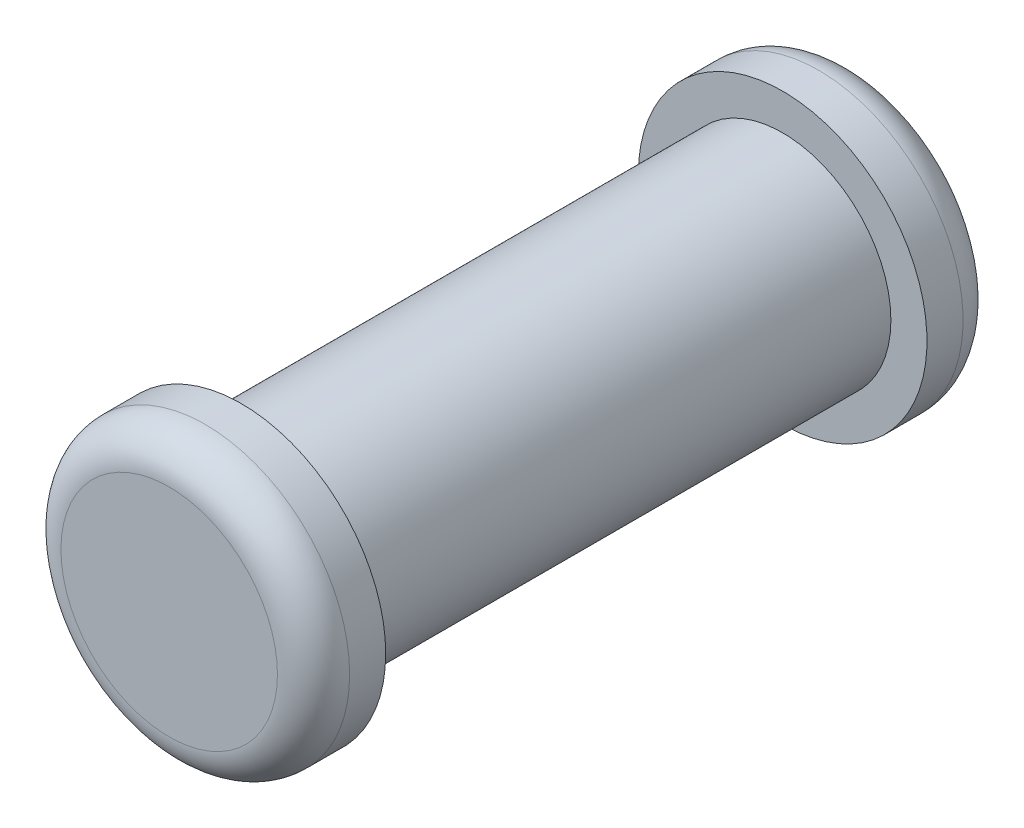
ISO-10303-21;
HEADER;
FILE_DESCRIPTION(('STEP AP214'),'2;1');
FILE_NAME('part.step','',(''),(''),'','','');
FILE_SCHEMA(('AUTOMOTIVE_DESIGN { 1 0 10303 214 1 1 1 1 }'));
ENDSEC;
DATA;
#1=APPLICATION_CONTEXT('core data for automotive mechanical design processes');
#2=APPLICATION_PROTOCOL_DEFINITION('international standard','automotive_design',2000,#1);
#3=PRODUCT_CONTEXT('',#1,'mechanical');
#4=PRODUCT('Part','Part','',(#3));
#5=PRODUCT_RELATED_PRODUCT_CATEGORY('part','',(#4));
#6=PRODUCT_DEFINITION_FORMATION('','',#4);
#7=PRODUCT_DEFINITION_CONTEXT('part definition',#1,'design');
#8=PRODUCT_DEFINITION('design','',#6,#7);
#9=PRODUCT_DEFINITION_SHAPE('','',#8);
#10=(LENGTH_UNIT() NAMED_UNIT(*) SI_UNIT(.MILLI.,.METRE.));
#11=(NAMED_UNIT(*) PLANE_ANGLE_UNIT() SI_UNIT($,.RADIAN.));
#12=(NAMED_UNIT(*) SI_UNIT($,.STERADIAN.) SOLID_ANGLE_UNIT());
#13=UNCERTAINTY_MEASURE_WITH_UNIT(LENGTH_MEASURE(1.E-05),#10,'distance_accuracy_value','');
#14=(GEOMETRIC_REPRESENTATION_CONTEXT(3) GLOBAL_UNCERTAINTY_ASSIGNED_CONTEXT((#13)) GLOBAL_UNIT_ASSIGNED_CONTEXT((#10,
#11,#12)) REPRESENTATION_CONTEXT('',''));
#15=CARTESIAN_POINT('',(0.,0.,0.));
#16=DIRECTION('',(0.,0.,1.));
#17=DIRECTION('',(1.,0.,0.));
#18=AXIS2_PLACEMENT_3D('',#15,#16,#17);
#19=CARTESIAN_POINT('',(0.,0.,7.5));
#20=DIRECTION('',(0.,0.,-1.));
#21=DIRECTION('',(-1.,0.,0.));
#22=AXIS2_PLACEMENT_3D('',#19,#20,#21);
#23=CYLINDRICAL_SURFACE('',#22,1.5);
#24=CARTESIAN_POINT('',(0.,0.,7.5));
#25=DIRECTION('',(0.,0.,1.));
#26=DIRECTION('',(1.,0.,0.));
#27=AXIS2_PLACEMENT_3D('',#24,#25,#26);
#28=CIRCLE('',#27,1.5);
#29=CARTESIAN_POINT('',(1.5,0.,7.5));
#30=VERTEX_POINT('',#29);
#31=EDGE_CURVE('E59',#30,#30,#28,.T.);
#32=ORIENTED_EDGE('',*,*,#31,.F.);
#33=EDGE_LOOP('',(#32));
#34=FACE_BOUND('',#33,.T.);
#35=CARTESIAN_POINT('',(0.,0.,0.));
#36=DIRECTION('',(0.,0.,1.));
#37=DIRECTION('',(1.,0.,0.));
#38=AXIS2_PLACEMENT_3D('',#35,#36,#37);
#39=CIRCLE('',#38,1.5);
#40=CARTESIAN_POINT('',(1.5,0.,0.));
#41=VERTEX_POINT('',#40);
#42=EDGE_CURVE('E60',#41,#41,#39,.T.);
#43=ORIENTED_EDGE('',*,*,#42,.T.);
#44=EDGE_LOOP('',(#43));
#45=FACE_BOUND('',#44,.T.);
#46=ADVANCED_FACE('F39',(#34,#45),#23,.T.);
#47=CARTESIAN_POINT('',(0.,0.,-1.));
#48=DIRECTION('',(0.,0.,1.));
#49=DIRECTION('',(1.,0.,0.));
#50=AXIS2_PLACEMENT_3D('',#47,#48,#49);
#51=CYLINDRICAL_SURFACE('',#50,2.);
#52=CARTESIAN_POINT('',(0.,0.,-0.5));
#53=DIRECTION('',(0.,0.,-1.));
#54=DIRECTION('',(-1.,0.,0.));
#55=AXIS2_PLACEMENT_3D('',#52,#53,#54);
#56=CIRCLE('',#55,2.);
#57=CARTESIAN_POINT('',(-2.,0.,-0.5));
#58=VERTEX_POINT('',#57);
#59=EDGE_CURVE('E50',#58,#58,#56,.F.);
#60=ORIENTED_EDGE('',*,*,#59,.T.);
#61=EDGE_LOOP('',(#60));
#62=FACE_BOUND('',#61,.T.);
#63=CARTESIAN_POINT('',(0.,0.,0.));
#64=DIRECTION('',(0.,0.,-1.));
#65=DIRECTION('',(-1.,0.,0.));
#66=AXIS2_PLACEMENT_3D('',#63,#64,#65);
#67=CIRCLE('',#66,2.);
#68=CARTESIAN_POINT('',(-2.,0.,0.));
#69=VERTEX_POINT('',#68);
#70=EDGE_CURVE('E63',#69,#69,#67,.T.);
#71=ORIENTED_EDGE('',*,*,#70,.T.);
#72=EDGE_LOOP('',(#71));
#73=FACE_BOUND('',#72,.T.);
#74=ADVANCED_FACE('F90',(#62,#73),#51,.T.);
#75=CARTESIAN_POINT('',(0.,0.,-1.));
#76=DIRECTION('',(0.,0.,-1.));
#77=DIRECTION('',(-1.,0.,0.));
#78=AXIS2_PLACEMENT_3D('',#75,#76,#77);
#79=PLANE('',#78);
#80=CARTESIAN_POINT('',(0.,0.,-1.));
#81=DIRECTION('',(0.,0.,-1.));
#82=DIRECTION('',(-1.,0.,0.));
#83=AXIS2_PLACEMENT_3D('',#80,#81,#82);
#84=CIRCLE('',#83,1.5);
#85=CARTESIAN_POINT('',(-1.5,0.,-1.));
#86=VERTEX_POINT('',#85);
#87=EDGE_CURVE('E54',#86,#86,#84,.T.);
#88=ORIENTED_EDGE('',*,*,#87,.T.);
#89=EDGE_LOOP('',(#88));
#90=FACE_BOUND('',#89,.T.);
#91=ADVANCED_FACE('F95',(#90),#79,.T.);
#92=CARTESIAN_POINT('',(0.,0.,0.));
#93=DIRECTION('',(0.,0.,-1.));
#94=DIRECTION('',(-1.,0.,0.));
#95=AXIS2_PLACEMENT_3D('',#92,#93,#94);
#96=PLANE('',#95);
#97=ORIENTED_EDGE('',*,*,#42,.F.);
#98=EDGE_LOOP('',(#97));
#99=FACE_BOUND('',#98,.T.);
#100=ORIENTED_EDGE('',*,*,#70,.F.);
#101=EDGE_LOOP('',(#100));
#102=FACE_BOUND('',#101,.T.);
#103=ADVANCED_FACE('F101',(#99,#102),#96,.F.);
#104=CARTESIAN_POINT('',(0.,0.,8.5));
#105=DIRECTION('',(0.,0.,-1.));
#106=DIRECTION('',(-1.,0.,0.));
#107=AXIS2_PLACEMENT_3D('',#104,#105,#106);
#108=CYLINDRICAL_SURFACE('',#107,2.);
#109=CARTESIAN_POINT('',(0.,0.,8.));
#110=DIRECTION('',(0.,0.,1.));
#111=DIRECTION('',(1.,0.,0.));
#112=AXIS2_PLACEMENT_3D('',#109,#110,#111);
#113=CIRCLE('',#112,2.);
#114=CARTESIAN_POINT('',(2.,0.,8.));
#115=VERTEX_POINT('',#114);
#116=EDGE_CURVE('E10',#115,#115,#113,.F.);
#117=ORIENTED_EDGE('',*,*,#116,.T.);
#118=EDGE_LOOP('',(#117));
#119=FACE_BOUND('',#118,.T.);
#120=CARTESIAN_POINT('',(0.,0.,7.5));
#121=DIRECTION('',(0.,0.,1.));
#122=DIRECTION('',(1.,0.,0.));
#123=AXIS2_PLACEMENT_3D('',#120,#121,#122);
#124=CIRCLE('',#123,2.);
#125=CARTESIAN_POINT('',(2.,0.,7.5));
#126=VERTEX_POINT('',#125);
#127=EDGE_CURVE('E68',#126,#126,#124,.T.);
#128=ORIENTED_EDGE('',*,*,#127,.T.);
#129=EDGE_LOOP('',(#128));
#130=FACE_BOUND('',#129,.T.);
#131=ADVANCED_FACE('F72',(#119,#130),#108,.T.);
#132=CARTESIAN_POINT('',(0.,0.,8.5));
#133=DIRECTION('',(0.,0.,1.));
#134=DIRECTION('',(1.,0.,0.));
#135=AXIS2_PLACEMENT_3D('',#132,#133,#134);
#136=PLANE('',#135);
#137=CARTESIAN_POINT('',(0.,0.,8.5));
#138=DIRECTION('',(0.,0.,1.));
#139=DIRECTION('',(1.,0.,0.));
#140=AXIS2_PLACEMENT_3D('',#137,#138,#139);
#141=CIRCLE('',#140,1.5);
#142=CARTESIAN_POINT('',(1.5,0.,8.5));
#143=VERTEX_POINT('',#142);
#144=EDGE_CURVE('E46',#143,#143,#141,.T.);
#145=ORIENTED_EDGE('',*,*,#144,.T.);
#146=EDGE_LOOP('',(#145));
#147=FACE_BOUND('',#146,.T.);
#148=ADVANCED_FACE('F77',(#147),#136,.T.);
#149=CARTESIAN_POINT('',(0.,0.,7.5));
#150=DIRECTION('',(0.,0.,1.));
#151=DIRECTION('',(1.,0.,0.));
#152=AXIS2_PLACEMENT_3D('',#149,#150,#151);
#153=PLANE('',#152);
#154=ORIENTED_EDGE('',*,*,#31,.T.);
#155=EDGE_LOOP('',(#154));
#156=FACE_BOUND('',#155,.T.);
#157=ORIENTED_EDGE('',*,*,#127,.F.);
#158=EDGE_LOOP('',(#157));
#159=FACE_BOUND('',#158,.T.);
#160=ADVANCED_FACE('F74',(#156,#159),#153,.F.);
#161=CARTESIAN_POINT('',(0.,0.,-0.5));
#162=DIRECTION('',(0.,0.,-1.));
#163=DIRECTION('',(-1.,0.,0.));
#164=AXIS2_PLACEMENT_3D('',#161,#162,#163);
#165=TOROIDAL_SURFACE('',#164,1.5,0.5);
#166=ORIENTED_EDGE('',*,*,#59,.F.);
#167=EDGE_LOOP('',(#166));
#168=FACE_BOUND('',#167,.T.);
#169=ORIENTED_EDGE('',*,*,#87,.F.);
#170=EDGE_LOOP('',(#169));
#171=FACE_BOUND('',#170,.T.);
#172=ADVANCED_FACE('F76',(#168,#171),#165,.T.);
#173=CARTESIAN_POINT('',(0.,0.,8.));
#174=DIRECTION('',(0.,0.,1.));
#175=DIRECTION('',(1.,0.,0.));
#176=AXIS2_PLACEMENT_3D('',#173,#174,#175);
#177=TOROIDAL_SURFACE('',#176,1.5,0.5);
#178=ORIENTED_EDGE('',*,*,#116,.F.);
#179=EDGE_LOOP('',(#178));
#180=FACE_BOUND('',#179,.T.);
#181=ORIENTED_EDGE('',*,*,#144,.F.);
#182=EDGE_LOOP('',(#181));
#183=FACE_BOUND('',#182,.T.);
#184=ADVANCED_FACE('F41',(#180,#183),#177,.T.);
#185=CLOSED_SHELL('',(#46,#74,#91,#103,#131,#148,#160,#172,#184));
#186=MANIFOLD_SOLID_BREP('B2',#185);
#187=ADVANCED_BREP_SHAPE_REPRESENTATION('',(#18,#186),#14);
#188=SHAPE_DEFINITION_REPRESENTATION(#9,#187);
ENDSEC;
END-ISO-10303-21;
